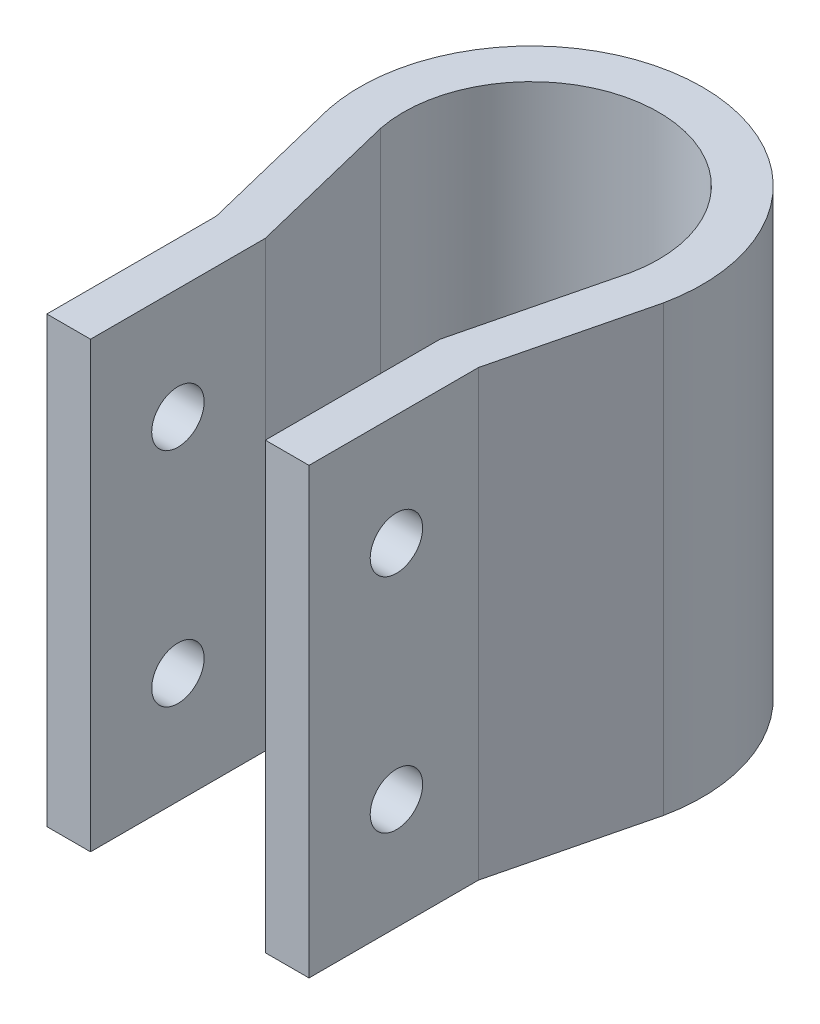
ISO-10303-21;
HEADER;
FILE_DESCRIPTION(('STEP AP214'),'2;1');
FILE_NAME('part.step','',(''),(''),'','','');
FILE_SCHEMA(('AUTOMOTIVE_DESIGN { 1 0 10303 214 1 1 1 1 }'));
ENDSEC;
DATA;
#1=APPLICATION_CONTEXT('core data for automotive mechanical design processes');
#2=APPLICATION_PROTOCOL_DEFINITION('international standard','automotive_design',2000,#1);
#3=PRODUCT_CONTEXT('',#1,'mechanical');
#4=PRODUCT('Part','Part','',(#3));
#5=PRODUCT_RELATED_PRODUCT_CATEGORY('part','',(#4));
#6=PRODUCT_DEFINITION_FORMATION('','',#4);
#7=PRODUCT_DEFINITION_CONTEXT('part definition',#1,'design');
#8=PRODUCT_DEFINITION('design','',#6,#7);
#9=PRODUCT_DEFINITION_SHAPE('','',#8);
#10=(LENGTH_UNIT() NAMED_UNIT(*) SI_UNIT(.MILLI.,.METRE.));
#11=(NAMED_UNIT(*) PLANE_ANGLE_UNIT() SI_UNIT($,.RADIAN.));
#12=(NAMED_UNIT(*) SI_UNIT($,.STERADIAN.) SOLID_ANGLE_UNIT());
#13=UNCERTAINTY_MEASURE_WITH_UNIT(LENGTH_MEASURE(1.E-05),#10,'distance_accuracy_value','');
#14=(GEOMETRIC_REPRESENTATION_CONTEXT(3) GLOBAL_UNCERTAINTY_ASSIGNED_CONTEXT((#13)) GLOBAL_UNIT_ASSIGNED_CONTEXT((#10,
#11,#12)) REPRESENTATION_CONTEXT('',''));
#15=CARTESIAN_POINT('',(0.,0.,0.));
#16=DIRECTION('',(0.,0.,1.));
#17=DIRECTION('',(1.,0.,0.));
#18=AXIS2_PLACEMENT_3D('',#15,#16,#17);
#19=CARTESIAN_POINT('',(-15.,254.,40.405));
#20=DIRECTION('',(0.,0.,1.));
#21=DIRECTION('',(1.,0.,0.));
#22=AXIS2_PLACEMENT_3D('',#19,#20,#21);
#23=PLANE('',#22);
#24=DIRECTION('',(1.,0.,0.));
#25=VECTOR('',#24,1.);
#26=CARTESIAN_POINT('',(-15.,304.8,40.405));
#27=LINE('',#26,#25);
#28=CARTESIAN_POINT('',(-15.,304.8,40.405));
#29=VERTEX_POINT('',#28);
#30=CARTESIAN_POINT('',(-10.,304.8,40.405));
#31=VERTEX_POINT('',#30);
#32=EDGE_CURVE('E167',#29,#31,#27,.T.);
#33=ORIENTED_EDGE('',*,*,#32,.F.);
#34=DIRECTION('',(0.,1.,0.));
#35=VECTOR('',#34,1.);
#36=CARTESIAN_POINT('',(-15.,254.,40.405));
#37=LINE('',#36,#35);
#38=CARTESIAN_POINT('',(-15.,254.,40.405));
#39=VERTEX_POINT('',#38);
#40=EDGE_CURVE('E11',#39,#29,#37,.T.);
#41=ORIENTED_EDGE('',*,*,#40,.F.);
#42=DIRECTION('',(1.,0.,0.));
#43=VECTOR('',#42,1.);
#44=CARTESIAN_POINT('',(-15.,254.,40.405));
#45=LINE('',#44,#43);
#46=CARTESIAN_POINT('',(-10.,254.,40.405));
#47=VERTEX_POINT('',#46);
#48=EDGE_CURVE('E200',#39,#47,#45,.T.);
#49=ORIENTED_EDGE('',*,*,#48,.T.);
#50=DIRECTION('',(0.,1.,0.));
#51=VECTOR('',#50,1.);
#52=CARTESIAN_POINT('',(-10.,254.,40.405));
#53=LINE('',#52,#51);
#54=EDGE_CURVE('E113',#47,#31,#53,.T.);
#55=ORIENTED_EDGE('',*,*,#54,.T.);
#56=EDGE_LOOP('',(#33,#41,#49,#55));
#57=FACE_BOUND('',#56,.T.);
#58=ADVANCED_FACE('F45',(#57),#23,.T.);
#59=CARTESIAN_POINT('',(-15.,254.,40.405));
#60=DIRECTION('',(-1.,0.,0.));
#61=DIRECTION('',(0.,0.,1.));
#62=AXIS2_PLACEMENT_3D('',#59,#60,#61);
#63=PLANE('',#62);
#64=CARTESIAN_POINT('',(-15.,292.1,30.405));
#65=DIRECTION('',(-1.,0.,0.));
#66=DIRECTION('',(0.,0.,1.));
#67=AXIS2_PLACEMENT_3D('',#64,#65,#66);
#68=CIRCLE('',#67,3.);
#69=CARTESIAN_POINT('',(-15.,292.1,33.405));
#70=VERTEX_POINT('',#69);
#71=EDGE_CURVE('E221',#70,#70,#68,.T.);
#72=ORIENTED_EDGE('',*,*,#71,.F.);
#73=EDGE_LOOP('',(#72));
#74=FACE_BOUND('',#73,.T.);
#75=CARTESIAN_POINT('',(-15.,266.7,30.405));
#76=DIRECTION('',(-1.,0.,0.));
#77=DIRECTION('',(0.,0.,-1.));
#78=AXIS2_PLACEMENT_3D('',#75,#76,#77);
#79=CIRCLE('',#78,3.);
#80=CARTESIAN_POINT('',(-15.,266.7,27.405));
#81=VERTEX_POINT('',#80);
#82=EDGE_CURVE('E228',#81,#81,#79,.T.);
#83=ORIENTED_EDGE('',*,*,#82,.F.);
#84=EDGE_LOOP('',(#83));
#85=FACE_BOUND('',#84,.T.);
#86=DIRECTION('',(0.,0.,1.));
#87=VECTOR('',#86,1.);
#88=CARTESIAN_POINT('',(-15.,304.8,40.405));
#89=LINE('',#88,#87);
#90=CARTESIAN_POINT('',(-15.,304.8,21.0108095906005));
#91=VERTEX_POINT('',#90);
#92=EDGE_CURVE('E198',#91,#29,#89,.T.);
#93=ORIENTED_EDGE('',*,*,#92,.F.);
#94=DIRECTION('',(0.,1.,0.));
#95=VECTOR('',#94,1.);
#96=CARTESIAN_POINT('',(-15.,254.,21.0108095906005));
#97=LINE('',#96,#95);
#98=CARTESIAN_POINT('',(-15.,254.,21.0108095906005));
#99=VERTEX_POINT('',#98);
#100=EDGE_CURVE('E54',#99,#91,#97,.T.);
#101=ORIENTED_EDGE('',*,*,#100,.F.);
#102=DIRECTION('',(0.,0.,1.));
#103=VECTOR('',#102,1.);
#104=CARTESIAN_POINT('',(-15.,254.,40.405));
#105=LINE('',#104,#103);
#106=EDGE_CURVE('E157',#99,#39,#105,.T.);
#107=ORIENTED_EDGE('',*,*,#106,.T.);
#108=ORIENTED_EDGE('',*,*,#40,.T.);
#109=EDGE_LOOP('',(#93,#101,#107,#108));
#110=FACE_BOUND('',#109,.T.);
#111=ADVANCED_FACE('F288',(#74,#85,#110),#63,.T.);
#112=CARTESIAN_POINT('',(-15.,254.,21.0108095906005));
#113=DIRECTION('',(-0.971064360471332,0.,0.238817938652864));
#114=DIRECTION('',(0.238817938652864,0.,0.971064360471332));
#115=AXIS2_PLACEMENT_3D('',#112,#113,#114);
#116=PLANE('',#115);
#117=DIRECTION('',(0.238817938652864,0.,0.971064360471332));
#118=VECTOR('',#117,1.);
#119=CARTESIAN_POINT('',(-15.,304.8,21.0108095906005));
#120=LINE('',#119,#118);
#121=CARTESIAN_POINT('',(-19.1757924641354,304.8,4.03150199955395));
#122=VERTEX_POINT('',#121);
#123=EDGE_CURVE('E144',#122,#91,#120,.T.);
#124=ORIENTED_EDGE('',*,*,#123,.F.);
#125=DIRECTION('',(0.,1.,0.));
#126=VECTOR('',#125,1.);
#127=CARTESIAN_POINT('',(-19.1757924641354,254.,4.03150199955395));
#128=LINE('',#127,#126);
#129=CARTESIAN_POINT('',(-19.1757924641354,254.,4.03150199955395));
#130=VERTEX_POINT('',#129);
#131=EDGE_CURVE('E139',#130,#122,#128,.T.);
#132=ORIENTED_EDGE('',*,*,#131,.F.);
#133=DIRECTION('',(0.238817938652864,0.,0.971064360471332));
#134=VECTOR('',#133,1.);
#135=CARTESIAN_POINT('',(-15.,254.,21.0108095906005));
#136=LINE('',#135,#134);
#137=EDGE_CURVE('E142',#130,#99,#136,.T.);
#138=ORIENTED_EDGE('',*,*,#137,.T.);
#139=ORIENTED_EDGE('',*,*,#100,.T.);
#140=EDGE_LOOP('',(#124,#132,#138,#139));
#141=FACE_BOUND('',#140,.T.);
#142=ADVANCED_FACE('F141',(#141),#116,.T.);
#143=CARTESIAN_POINT('',(0.,254.,0.));
#144=DIRECTION('',(0.,1.,0.));
#145=DIRECTION('',(0.,0.,1.));
#146=AXIS2_PLACEMENT_3D('',#143,#144,#145);
#147=CYLINDRICAL_SURFACE('',#146,19.595);
#148=CARTESIAN_POINT('',(0.,304.8,0.));
#149=DIRECTION('',(0.,1.,0.));
#150=DIRECTION('',(0.,0.,-1.));
#151=AXIS2_PLACEMENT_3D('',#148,#149,#150);
#152=CIRCLE('',#151,19.595);
#153=CARTESIAN_POINT('',(19.1757924641355,304.8,4.03150199955374));
#154=VERTEX_POINT('',#153);
#155=EDGE_CURVE('E195',#154,#122,#152,.T.);
#156=ORIENTED_EDGE('',*,*,#155,.F.);
#157=DIRECTION('',(0.,1.,0.));
#158=VECTOR('',#157,1.);
#159=CARTESIAN_POINT('',(19.1757924641355,254.,4.03150199955374));
#160=LINE('',#159,#158);
#161=CARTESIAN_POINT('',(19.1757924641355,254.,4.03150199955374));
#162=VERTEX_POINT('',#161);
#163=EDGE_CURVE('E149',#162,#154,#160,.T.);
#164=ORIENTED_EDGE('',*,*,#163,.F.);
#165=CARTESIAN_POINT('',(0.,254.,0.));
#166=DIRECTION('',(0.,1.,0.));
#167=DIRECTION('',(0.,0.,-1.));
#168=AXIS2_PLACEMENT_3D('',#165,#166,#167);
#169=CIRCLE('',#168,19.595);
#170=EDGE_CURVE('E155',#162,#130,#169,.T.);
#171=ORIENTED_EDGE('',*,*,#170,.T.);
#172=ORIENTED_EDGE('',*,*,#131,.T.);
#173=EDGE_LOOP('',(#156,#164,#171,#172));
#174=FACE_BOUND('',#173,.T.);
#175=ADVANCED_FACE('F159',(#174),#147,.T.);
#176=CARTESIAN_POINT('',(19.1757924641355,254.,4.03150199955374));
#177=DIRECTION('',(0.971064360471332,0.,0.238817938652864));
#178=DIRECTION('',(0.238817938652864,0.,-0.971064360471332));
#179=AXIS2_PLACEMENT_3D('',#176,#177,#178);
#180=PLANE('',#179);
#181=DIRECTION('',(0.238817938652864,0.,-0.971064360471332));
#182=VECTOR('',#181,1.);
#183=CARTESIAN_POINT('',(19.1757924641355,304.8,4.03150199955374));
#184=LINE('',#183,#182);
#185=CARTESIAN_POINT('',(15.,304.8,21.0108095906005));
#186=VERTEX_POINT('',#185);
#187=EDGE_CURVE('E192',#186,#154,#184,.T.);
#188=ORIENTED_EDGE('',*,*,#187,.F.);
#189=DIRECTION('',(0.,1.,0.));
#190=VECTOR('',#189,1.);
#191=CARTESIAN_POINT('',(15.,254.,21.0108095906005));
#192=LINE('',#191,#190);
#193=CARTESIAN_POINT('',(15.,254.,21.0108095906005));
#194=VERTEX_POINT('',#193);
#195=EDGE_CURVE('E204',#194,#186,#192,.T.);
#196=ORIENTED_EDGE('',*,*,#195,.F.);
#197=DIRECTION('',(0.238817938652864,0.,-0.971064360471332));
#198=VECTOR('',#197,1.);
#199=CARTESIAN_POINT('',(19.1757924641355,254.,4.03150199955374));
#200=LINE('',#199,#198);
#201=EDGE_CURVE('E160',#194,#162,#200,.T.);
#202=ORIENTED_EDGE('',*,*,#201,.T.);
#203=ORIENTED_EDGE('',*,*,#163,.T.);
#204=EDGE_LOOP('',(#188,#196,#202,#203));
#205=FACE_BOUND('',#204,.T.);
#206=ADVANCED_FACE('F304',(#205),#180,.T.);
#207=CARTESIAN_POINT('',(15.,254.,21.0108095906005));
#208=DIRECTION('',(1.,0.,0.));
#209=DIRECTION('',(0.,0.,-1.));
#210=AXIS2_PLACEMENT_3D('',#207,#208,#209);
#211=PLANE('',#210);
#212=CARTESIAN_POINT('',(15.,292.1,30.405));
#213=DIRECTION('',(1.,0.,0.));
#214=DIRECTION('',(0.,0.,-1.));
#215=AXIS2_PLACEMENT_3D('',#212,#213,#214);
#216=CIRCLE('',#215,3.);
#217=CARTESIAN_POINT('',(15.,292.1,27.405));
#218=VERTEX_POINT('',#217);
#219=EDGE_CURVE('E171',#218,#218,#216,.T.);
#220=ORIENTED_EDGE('',*,*,#219,.F.);
#221=EDGE_LOOP('',(#220));
#222=FACE_BOUND('',#221,.T.);
#223=CARTESIAN_POINT('',(15.,266.7,30.405));
#224=DIRECTION('',(1.,0.,0.));
#225=DIRECTION('',(0.,0.,-1.));
#226=AXIS2_PLACEMENT_3D('',#223,#224,#225);
#227=CIRCLE('',#226,3.);
#228=CARTESIAN_POINT('',(15.,266.7,27.405));
#229=VERTEX_POINT('',#228);
#230=EDGE_CURVE('E225',#229,#229,#227,.T.);
#231=ORIENTED_EDGE('',*,*,#230,.F.);
#232=EDGE_LOOP('',(#231));
#233=FACE_BOUND('',#232,.T.);
#234=DIRECTION('',(0.,0.,-1.));
#235=VECTOR('',#234,1.);
#236=CARTESIAN_POINT('',(15.,304.8,21.0108095906005));
#237=LINE('',#236,#235);
#238=CARTESIAN_POINT('',(15.,304.8,40.405));
#239=VERTEX_POINT('',#238);
#240=EDGE_CURVE('E189',#239,#186,#237,.T.);
#241=ORIENTED_EDGE('',*,*,#240,.F.);
#242=DIRECTION('',(0.,1.,0.));
#243=VECTOR('',#242,1.);
#244=CARTESIAN_POINT('',(15.,254.,40.405));
#245=LINE('',#244,#243);
#246=CARTESIAN_POINT('',(15.,254.,40.405));
#247=VERTEX_POINT('',#246);
#248=EDGE_CURVE('E206',#247,#239,#245,.T.);
#249=ORIENTED_EDGE('',*,*,#248,.F.);
#250=DIRECTION('',(0.,0.,-1.));
#251=VECTOR('',#250,1.);
#252=CARTESIAN_POINT('',(15.,254.,21.0108095906005));
#253=LINE('',#252,#251);
#254=EDGE_CURVE('E162',#247,#194,#253,.T.);
#255=ORIENTED_EDGE('',*,*,#254,.T.);
#256=ORIENTED_EDGE('',*,*,#195,.T.);
#257=EDGE_LOOP('',(#241,#249,#255,#256));
#258=FACE_BOUND('',#257,.T.);
#259=ADVANCED_FACE('F263',(#222,#233,#258),#211,.T.);
#260=CARTESIAN_POINT('',(10.,254.,40.405));
#261=DIRECTION('',(0.,0.,1.));
#262=DIRECTION('',(1.,0.,0.));
#263=AXIS2_PLACEMENT_3D('',#260,#261,#262);
#264=PLANE('',#263);
#265=DIRECTION('',(1.,0.,0.));
#266=VECTOR('',#265,1.);
#267=CARTESIAN_POINT('',(10.,304.8,40.405));
#268=LINE('',#267,#266);
#269=CARTESIAN_POINT('',(10.,304.8,40.405));
#270=VERTEX_POINT('',#269);
#271=EDGE_CURVE('E186',#270,#239,#268,.T.);
#272=ORIENTED_EDGE('',*,*,#271,.F.);
#273=DIRECTION('',(0.,1.,0.));
#274=VECTOR('',#273,1.);
#275=CARTESIAN_POINT('',(10.,254.,40.405));
#276=LINE('',#275,#274);
#277=CARTESIAN_POINT('',(10.,254.,40.405));
#278=VERTEX_POINT('',#277);
#279=EDGE_CURVE('E208',#278,#270,#276,.T.);
#280=ORIENTED_EDGE('',*,*,#279,.F.);
#281=DIRECTION('',(1.,0.,0.));
#282=VECTOR('',#281,1.);
#283=CARTESIAN_POINT('',(10.,254.,40.405));
#284=LINE('',#283,#282);
#285=EDGE_CURVE('E257',#278,#247,#284,.T.);
#286=ORIENTED_EDGE('',*,*,#285,.T.);
#287=ORIENTED_EDGE('',*,*,#248,.T.);
#288=EDGE_LOOP('',(#272,#280,#286,#287));
#289=FACE_BOUND('',#288,.T.);
#290=ADVANCED_FACE('F269',(#289),#264,.T.);
#291=CARTESIAN_POINT('',(10.,254.,20.405));
#292=DIRECTION('',(-1.,0.,0.));
#293=DIRECTION('',(0.,0.,1.));
#294=AXIS2_PLACEMENT_3D('',#291,#292,#293);
#295=PLANE('',#294);
#296=CARTESIAN_POINT('',(10.,292.1,30.405));
#297=DIRECTION('',(-1.,0.,0.));
#298=DIRECTION('',(0.,0.,1.));
#299=AXIS2_PLACEMENT_3D('',#296,#297,#298);
#300=CIRCLE('',#299,3.);
#301=CARTESIAN_POINT('',(10.,292.1,33.405));
#302=VERTEX_POINT('',#301);
#303=EDGE_CURVE('E237',#302,#302,#300,.T.);
#304=ORIENTED_EDGE('',*,*,#303,.F.);
#305=EDGE_LOOP('',(#304));
#306=FACE_BOUND('',#305,.T.);
#307=CARTESIAN_POINT('',(10.,266.7,30.405));
#308=DIRECTION('',(-1.,0.,0.));
#309=DIRECTION('',(0.,0.,1.));
#310=AXIS2_PLACEMENT_3D('',#307,#308,#309);
#311=CIRCLE('',#310,3.);
#312=CARTESIAN_POINT('',(10.,266.7,33.405));
#313=VERTEX_POINT('',#312);
#314=EDGE_CURVE('E220',#313,#313,#311,.T.);
#315=ORIENTED_EDGE('',*,*,#314,.F.);
#316=EDGE_LOOP('',(#315));
#317=FACE_BOUND('',#316,.T.);
#318=DIRECTION('',(0.,0.,1.));
#319=VECTOR('',#318,1.);
#320=CARTESIAN_POINT('',(10.,304.8,20.405));
#321=LINE('',#320,#319);
#322=CARTESIAN_POINT('',(10.,304.8,20.405));
#323=VERTEX_POINT('',#322);
#324=EDGE_CURVE('E183',#323,#270,#321,.T.);
#325=ORIENTED_EDGE('',*,*,#324,.F.);
#326=DIRECTION('',(0.,1.,0.));
#327=VECTOR('',#326,1.);
#328=CARTESIAN_POINT('',(10.,254.,20.405));
#329=LINE('',#328,#327);
#330=CARTESIAN_POINT('',(10.,254.,20.405));
#331=VERTEX_POINT('',#330);
#332=EDGE_CURVE('E210',#331,#323,#329,.T.);
#333=ORIENTED_EDGE('',*,*,#332,.F.);
#334=DIRECTION('',(0.,0.,1.));
#335=VECTOR('',#334,1.);
#336=CARTESIAN_POINT('',(10.,254.,20.405));
#337=LINE('',#336,#335);
#338=EDGE_CURVE('E254',#331,#278,#337,.T.);
#339=ORIENTED_EDGE('',*,*,#338,.T.);
#340=ORIENTED_EDGE('',*,*,#279,.T.);
#341=EDGE_LOOP('',(#325,#333,#339,#340));
#342=FACE_BOUND('',#341,.T.);
#343=ADVANCED_FACE('F272',(#306,#317,#342),#295,.T.);
#344=CARTESIAN_POINT('',(14.2987228957516,254.,2.92584151151603));
#345=DIRECTION('',(-0.971064360471332,0.,-0.238817938652864));
#346=DIRECTION('',(-0.238817938652864,0.,0.971064360471332));
#347=AXIS2_PLACEMENT_3D('',#344,#345,#346);
#348=PLANE('',#347);
#349=DIRECTION('',(-0.238817938652864,0.,0.971064360471332));
#350=VECTOR('',#349,1.);
#351=CARTESIAN_POINT('',(14.2987228957516,304.8,2.92584151151603));
#352=LINE('',#351,#350);
#353=CARTESIAN_POINT('',(14.2987228957516,304.8,2.92584151151603));
#354=VERTEX_POINT('',#353);
#355=EDGE_CURVE('E180',#354,#323,#352,.T.);
#356=ORIENTED_EDGE('',*,*,#355,.F.);
#357=DIRECTION('',(0.,1.,0.));
#358=VECTOR('',#357,1.);
#359=CARTESIAN_POINT('',(14.2987228957516,254.,2.92584151151603));
#360=LINE('',#359,#358);
#361=CARTESIAN_POINT('',(14.2987228957516,254.,2.92584151151603));
#362=VERTEX_POINT('',#361);
#363=EDGE_CURVE('E212',#362,#354,#360,.T.);
#364=ORIENTED_EDGE('',*,*,#363,.F.);
#365=DIRECTION('',(-0.238817938652864,0.,0.971064360471332));
#366=VECTOR('',#365,1.);
#367=CARTESIAN_POINT('',(14.2987228957516,254.,2.92584151151603));
#368=LINE('',#367,#366);
#369=EDGE_CURVE('E251',#362,#331,#368,.T.);
#370=ORIENTED_EDGE('',*,*,#369,.T.);
#371=ORIENTED_EDGE('',*,*,#332,.T.);
#372=EDGE_LOOP('',(#356,#364,#370,#371));
#373=FACE_BOUND('',#372,.T.);
#374=ADVANCED_FACE('F277',(#373),#348,.T.);
#375=CARTESIAN_POINT('',(0.,254.,0.));
#376=DIRECTION('',(0.,1.,0.));
#377=DIRECTION('',(0.,0.,1.));
#378=AXIS2_PLACEMENT_3D('',#375,#376,#377);
#379=CYLINDRICAL_SURFACE('',#378,14.595);
#380=CARTESIAN_POINT('',(0.,304.8,0.));
#381=DIRECTION('',(0.,-1.,0.));
#382=DIRECTION('',(0.,0.,-1.));
#383=AXIS2_PLACEMENT_3D('',#380,#381,#382);
#384=CIRCLE('',#383,14.595);
#385=CARTESIAN_POINT('',(-14.2987228957516,304.8,2.92584151151603));
#386=VERTEX_POINT('',#385);
#387=EDGE_CURVE('E177',#386,#354,#384,.T.);
#388=ORIENTED_EDGE('',*,*,#387,.F.);
#389=DIRECTION('',(0.,1.,0.));
#390=VECTOR('',#389,1.);
#391=CARTESIAN_POINT('',(-14.2987228957516,254.,2.92584151151603));
#392=LINE('',#391,#390);
#393=CARTESIAN_POINT('',(-14.2987228957516,254.,2.92584151151603));
#394=VERTEX_POINT('',#393);
#395=EDGE_CURVE('E214',#394,#386,#392,.T.);
#396=ORIENTED_EDGE('',*,*,#395,.F.);
#397=CARTESIAN_POINT('',(0.,254.,0.));
#398=DIRECTION('',(0.,-1.,0.));
#399=DIRECTION('',(0.,0.,-1.));
#400=AXIS2_PLACEMENT_3D('',#397,#398,#399);
#401=CIRCLE('',#400,14.595);
#402=EDGE_CURVE('E248',#394,#362,#401,.T.);
#403=ORIENTED_EDGE('',*,*,#402,.T.);
#404=ORIENTED_EDGE('',*,*,#363,.T.);
#405=EDGE_LOOP('',(#388,#396,#403,#404));
#406=FACE_BOUND('',#405,.T.);
#407=ADVANCED_FACE('F280',(#406),#379,.F.);
#408=CARTESIAN_POINT('',(-10.,254.,20.405));
#409=DIRECTION('',(0.971064360471332,0.,-0.238817938652864));
#410=DIRECTION('',(-0.238817938652864,0.,-0.971064360471332));
#411=AXIS2_PLACEMENT_3D('',#408,#409,#410);
#412=PLANE('',#411);
#413=DIRECTION('',(-0.238817938652864,0.,-0.971064360471332));
#414=VECTOR('',#413,1.);
#415=CARTESIAN_POINT('',(-10.,304.8,20.405));
#416=LINE('',#415,#414);
#417=CARTESIAN_POINT('',(-10.,304.8,20.405));
#418=VERTEX_POINT('',#417);
#419=EDGE_CURVE('E174',#418,#386,#416,.T.);
#420=ORIENTED_EDGE('',*,*,#419,.F.);
#421=DIRECTION('',(0.,1.,0.));
#422=VECTOR('',#421,1.);
#423=CARTESIAN_POINT('',(-10.,254.,20.405));
#424=LINE('',#423,#422);
#425=CARTESIAN_POINT('',(-10.,254.,20.405));
#426=VERTEX_POINT('',#425);
#427=EDGE_CURVE('E216',#426,#418,#424,.T.);
#428=ORIENTED_EDGE('',*,*,#427,.F.);
#429=DIRECTION('',(-0.238817938652864,0.,-0.971064360471332));
#430=VECTOR('',#429,1.);
#431=CARTESIAN_POINT('',(-10.,254.,20.405));
#432=LINE('',#431,#430);
#433=EDGE_CURVE('E245',#426,#394,#432,.T.);
#434=ORIENTED_EDGE('',*,*,#433,.T.);
#435=ORIENTED_EDGE('',*,*,#395,.T.);
#436=EDGE_LOOP('',(#420,#428,#434,#435));
#437=FACE_BOUND('',#436,.T.);
#438=ADVANCED_FACE('F284',(#437),#412,.T.);
#439=CARTESIAN_POINT('',(-10.,254.,40.405));
#440=DIRECTION('',(1.,0.,0.));
#441=DIRECTION('',(0.,0.,-1.));
#442=AXIS2_PLACEMENT_3D('',#439,#440,#441);
#443=PLANE('',#442);
#444=CARTESIAN_POINT('',(-10.,292.1,30.405));
#445=DIRECTION('',(1.,0.,0.));
#446=DIRECTION('',(0.,0.,-1.));
#447=AXIS2_PLACEMENT_3D('',#444,#445,#446);
#448=CIRCLE('',#447,3.);
#449=CARTESIAN_POINT('',(-10.,292.1,27.405));
#450=VERTEX_POINT('',#449);
#451=EDGE_CURVE('E48',#450,#450,#448,.T.);
#452=ORIENTED_EDGE('',*,*,#451,.F.);
#453=EDGE_LOOP('',(#452));
#454=FACE_BOUND('',#453,.T.);
#455=CARTESIAN_POINT('',(-10.,266.7,30.405));
#456=DIRECTION('',(1.,0.,0.));
#457=DIRECTION('',(0.,0.,-1.));
#458=AXIS2_PLACEMENT_3D('',#455,#456,#457);
#459=CIRCLE('',#458,3.);
#460=CARTESIAN_POINT('',(-10.,266.7,27.405));
#461=VERTEX_POINT('',#460);
#462=EDGE_CURVE('E218',#461,#461,#459,.T.);
#463=ORIENTED_EDGE('',*,*,#462,.F.);
#464=EDGE_LOOP('',(#463));
#465=FACE_BOUND('',#464,.T.);
#466=DIRECTION('',(0.,0.,-1.));
#467=VECTOR('',#466,1.);
#468=CARTESIAN_POINT('',(-10.,304.8,40.405));
#469=LINE('',#468,#467);
#470=EDGE_CURVE('E170',#31,#418,#469,.T.);
#471=ORIENTED_EDGE('',*,*,#470,.F.);
#472=ORIENTED_EDGE('',*,*,#54,.F.);
#473=DIRECTION('',(0.,0.,-1.));
#474=VECTOR('',#473,1.);
#475=CARTESIAN_POINT('',(-10.,254.,40.405));
#476=LINE('',#475,#474);
#477=EDGE_CURVE('E243',#47,#426,#476,.T.);
#478=ORIENTED_EDGE('',*,*,#477,.T.);
#479=ORIENTED_EDGE('',*,*,#427,.T.);
#480=EDGE_LOOP('',(#471,#472,#478,#479));
#481=FACE_BOUND('',#480,.T.);
#482=ADVANCED_FACE('F285',(#454,#465,#481),#443,.T.);
#483=CARTESIAN_POINT('',(0.,254.,0.));
#484=DIRECTION('',(0.,-1.,0.));
#485=DIRECTION('',(0.,0.,-1.));
#486=AXIS2_PLACEMENT_3D('',#483,#484,#485);
#487=PLANE('',#486);
#488=ORIENTED_EDGE('',*,*,#48,.F.);
#489=ORIENTED_EDGE('',*,*,#106,.F.);
#490=ORIENTED_EDGE('',*,*,#137,.F.);
#491=ORIENTED_EDGE('',*,*,#170,.F.);
#492=ORIENTED_EDGE('',*,*,#201,.F.);
#493=ORIENTED_EDGE('',*,*,#254,.F.);
#494=ORIENTED_EDGE('',*,*,#285,.F.);
#495=ORIENTED_EDGE('',*,*,#338,.F.);
#496=ORIENTED_EDGE('',*,*,#369,.F.);
#497=ORIENTED_EDGE('',*,*,#402,.F.);
#498=ORIENTED_EDGE('',*,*,#433,.F.);
#499=ORIENTED_EDGE('',*,*,#477,.F.);
#500=EDGE_LOOP('',(#488,#489,#490,#491,#492,#493,#494,#495,#496,#497,#498,#499));
#501=FACE_BOUND('',#500,.T.);
#502=ADVANCED_FACE('F153',(#501),#487,.T.);
#503=CARTESIAN_POINT('',(0.,304.8,0.));
#504=DIRECTION('',(0.,-1.,0.));
#505=DIRECTION('',(0.,0.,-1.));
#506=AXIS2_PLACEMENT_3D('',#503,#504,#505);
#507=PLANE('',#506);
#508=ORIENTED_EDGE('',*,*,#32,.T.);
#509=ORIENTED_EDGE('',*,*,#470,.T.);
#510=ORIENTED_EDGE('',*,*,#419,.T.);
#511=ORIENTED_EDGE('',*,*,#387,.T.);
#512=ORIENTED_EDGE('',*,*,#355,.T.);
#513=ORIENTED_EDGE('',*,*,#324,.T.);
#514=ORIENTED_EDGE('',*,*,#271,.T.);
#515=ORIENTED_EDGE('',*,*,#240,.T.);
#516=ORIENTED_EDGE('',*,*,#187,.T.);
#517=ORIENTED_EDGE('',*,*,#155,.T.);
#518=ORIENTED_EDGE('',*,*,#123,.T.);
#519=ORIENTED_EDGE('',*,*,#92,.T.);
#520=EDGE_LOOP('',(#508,#509,#510,#511,#512,#513,#514,#515,#516,#517,#518,#519));
#521=FACE_BOUND('',#520,.T.);
#522=ADVANCED_FACE('F287',(#521),#507,.F.);
#523=CARTESIAN_POINT('',(19.595,266.7,30.405));
#524=DIRECTION('',(-1.,0.,0.));
#525=DIRECTION('',(0.,0.,1.));
#526=AXIS2_PLACEMENT_3D('',#523,#524,#525);
#527=CYLINDRICAL_SURFACE('',#526,3.);
#528=ORIENTED_EDGE('',*,*,#462,.T.);
#529=EDGE_LOOP('',(#528));
#530=FACE_BOUND('',#529,.T.);
#531=ORIENTED_EDGE('',*,*,#82,.T.);
#532=EDGE_LOOP('',(#531));
#533=FACE_BOUND('',#532,.T.);
#534=ADVANCED_FACE('F334',(#530,#533),#527,.F.);
#535=CARTESIAN_POINT('',(19.595,292.1,30.405));
#536=DIRECTION('',(-1.,0.,0.));
#537=DIRECTION('',(0.,0.,1.));
#538=AXIS2_PLACEMENT_3D('',#535,#536,#537);
#539=CYLINDRICAL_SURFACE('',#538,3.);
#540=ORIENTED_EDGE('',*,*,#451,.T.);
#541=EDGE_LOOP('',(#540));
#542=FACE_BOUND('',#541,.T.);
#543=ORIENTED_EDGE('',*,*,#71,.T.);
#544=EDGE_LOOP('',(#543));
#545=FACE_BOUND('',#544,.T.);
#546=ADVANCED_FACE('F331',(#542,#545),#539,.F.);
#547=ORIENTED_EDGE('',*,*,#230,.T.);
#548=EDGE_LOOP('',(#547));
#549=FACE_BOUND('',#548,.T.);
#550=ORIENTED_EDGE('',*,*,#314,.T.);
#551=EDGE_LOOP('',(#550));
#552=FACE_BOUND('',#551,.T.);
#553=ADVANCED_FACE('F333',(#549,#552),#527,.F.);
#554=ORIENTED_EDGE('',*,*,#219,.T.);
#555=EDGE_LOOP('',(#554));
#556=FACE_BOUND('',#555,.T.);
#557=ORIENTED_EDGE('',*,*,#303,.T.);
#558=EDGE_LOOP('',(#557));
#559=FACE_BOUND('',#558,.T.);
#560=ADVANCED_FACE('F336',(#556,#559),#539,.F.);
#561=CLOSED_SHELL('',(#58,#111,#142,#175,#206,#259,#290,#343,#374,#407,#438,#482,#502,#522,#534,
#546,#553,#560));
#562=MANIFOLD_SOLID_BREP('B2',#561);
#563=ADVANCED_BREP_SHAPE_REPRESENTATION('',(#18,#562),#14);
#564=SHAPE_DEFINITION_REPRESENTATION(#9,#563);
ENDSEC;
END-ISO-10303-21;
